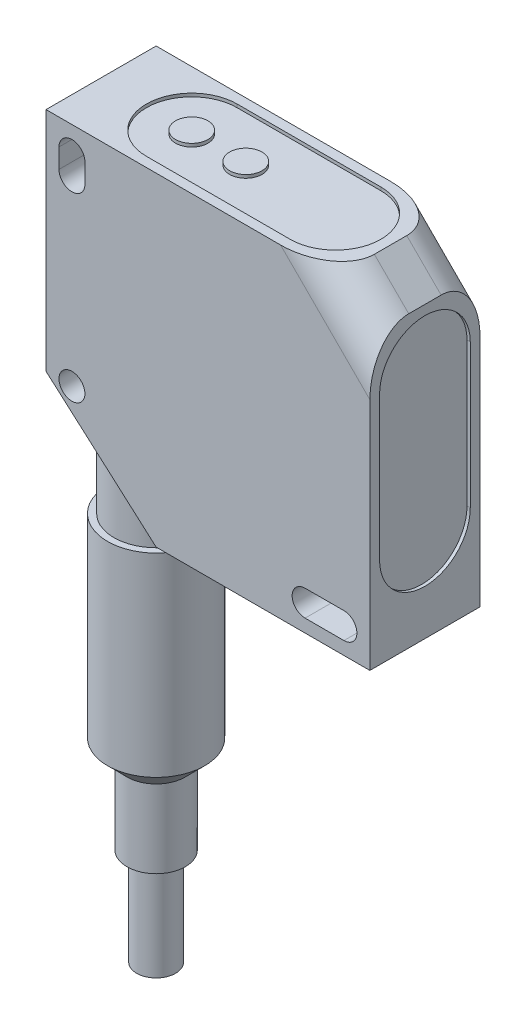
ISO-10303-21;
HEADER;
FILE_DESCRIPTION(('STEP AP214'),'2;1');
FILE_NAME('part.step','',(''),(''),'','','');
FILE_SCHEMA(('AUTOMOTIVE_DESIGN { 1 0 10303 214 1 1 1 1 }'));
ENDSEC;
DATA;
#1=APPLICATION_CONTEXT('core data for automotive mechanical design processes');
#2=APPLICATION_PROTOCOL_DEFINITION('international standard','automotive_design',2000,#1);
#3=PRODUCT_CONTEXT('',#1,'mechanical');
#4=PRODUCT('Part','Part','',(#3));
#5=PRODUCT_RELATED_PRODUCT_CATEGORY('part','',(#4));
#6=PRODUCT_DEFINITION_FORMATION('','',#4);
#7=PRODUCT_DEFINITION_CONTEXT('part definition',#1,'design');
#8=PRODUCT_DEFINITION('design','',#6,#7);
#9=PRODUCT_DEFINITION_SHAPE('','',#8);
#10=(LENGTH_UNIT() NAMED_UNIT(*) SI_UNIT(.MILLI.,.METRE.));
#11=(NAMED_UNIT(*) PLANE_ANGLE_UNIT() SI_UNIT($,.RADIAN.));
#12=(NAMED_UNIT(*) SI_UNIT($,.STERADIAN.) SOLID_ANGLE_UNIT());
#13=UNCERTAINTY_MEASURE_WITH_UNIT(LENGTH_MEASURE(1.E-05),#10,'distance_accuracy_value','');
#14=(GEOMETRIC_REPRESENTATION_CONTEXT(3) GLOBAL_UNCERTAINTY_ASSIGNED_CONTEXT((#13)) GLOBAL_UNIT_ASSIGNED_CONTEXT((#10,
#11,#12)) REPRESENTATION_CONTEXT('',''));
#15=CARTESIAN_POINT('',(0.,0.,0.));
#16=DIRECTION('',(0.,0.,1.));
#17=DIRECTION('',(1.,0.,0.));
#18=AXIS2_PLACEMENT_3D('',#15,#16,#17);
#19=CARTESIAN_POINT('',(8.50000000000001,-49.,8.5));
#20=DIRECTION('',(0.,-1.,0.));
#21=DIRECTION('',(0.,0.,-1.));
#22=AXIS2_PLACEMENT_3D('',#19,#20,#21);
#23=PLANE('',#22);
#24=CARTESIAN_POINT('',(8.50000000000001,-49.,8.5));
#25=DIRECTION('',(0.,-1.,0.));
#26=DIRECTION('',(0.,0.,-1.));
#27=AXIS2_PLACEMENT_3D('',#24,#25,#26);
#28=CIRCLE('',#27,3.99999999999998);
#29=CARTESIAN_POINT('',(8.50000000000001,-49.,4.50000000000002));
#30=VERTEX_POINT('',#29);
#31=EDGE_CURVE('E11',#30,#30,#28,.F.);
#32=ORIENTED_EDGE('',*,*,#31,.T.);
#33=EDGE_LOOP('',(#32));
#34=FACE_BOUND('',#33,.T.);
#35=CARTESIAN_POINT('',(8.50000000000001,-49.,8.5));
#36=DIRECTION('',(0.,-1.,0.));
#37=DIRECTION('',(0.,0.,-1.));
#38=AXIS2_PLACEMENT_3D('',#35,#36,#37);
#39=CIRCLE('',#38,4.5);
#40=CARTESIAN_POINT('',(8.50000000000001,-49.,4.));
#41=VERTEX_POINT('',#40);
#42=EDGE_CURVE('E267',#41,#41,#39,.T.);
#43=ORIENTED_EDGE('',*,*,#42,.T.);
#44=EDGE_LOOP('',(#43));
#45=FACE_BOUND('',#44,.T.);
#46=ADVANCED_FACE('F31',(#34,#45),#23,.T.);
#47=CARTESIAN_POINT('',(0.,50.,17.));
#48=DIRECTION('',(0.,0.,1.));
#49=DIRECTION('',(1.,0.,0.));
#50=AXIS2_PLACEMENT_3D('',#47,#48,#49);
#51=PLANE('',#50);
#52=CARTESIAN_POINT('',(4.,15.,17.));
#53=DIRECTION('',(0.,0.,1.));
#54=DIRECTION('',(1.,0.,0.));
#55=AXIS2_PLACEMENT_3D('',#52,#53,#54);
#56=CIRCLE('',#55,2.);
#57=CARTESIAN_POINT('',(6.,15.,17.));
#58=VERTEX_POINT('',#57);
#59=EDGE_CURVE('E314',#58,#58,#56,.T.);
#60=ORIENTED_EDGE('',*,*,#59,.F.);
#61=EDGE_LOOP('',(#60));
#62=FACE_BOUND('',#61,.T.);
#63=DIRECTION('',(0.,1.,0.));
#64=VECTOR('',#63,1.);
#65=CARTESIAN_POINT('',(50.,0.,17.));
#66=LINE('',#65,#64);
#67=CARTESIAN_POINT('',(50.,0.,17.));
#68=VERTEX_POINT('',#67);
#69=CARTESIAN_POINT('',(50.,36.2114177668624,17.));
#70=VERTEX_POINT('',#69);
#71=EDGE_CURVE('E360',#68,#70,#66,.T.);
#72=ORIENTED_EDGE('',*,*,#71,.T.);
#73=DIRECTION('',(-0.707106781186549,0.707106781186546,0.));
#74=VECTOR('',#73,1.);
#75=CARTESIAN_POINT('',(40.4540584539816,45.7573593128807,17.));
#76=LINE('',#75,#74);
#77=CARTESIAN_POINT('',(36.2114177668623,50.,17.));
#78=VERTEX_POINT('',#77);
#79=EDGE_CURVE('E405',#70,#78,#76,.T.);
#80=ORIENTED_EDGE('',*,*,#79,.T.);
#81=DIRECTION('',(-1.,0.,0.));
#82=VECTOR('',#81,1.);
#83=CARTESIAN_POINT('',(44.6966991411009,50.,17.));
#84=LINE('',#83,#82);
#85=CARTESIAN_POINT('',(0.,50.,17.));
#86=VERTEX_POINT('',#85);
#87=EDGE_CURVE('E351',#78,#86,#84,.T.);
#88=ORIENTED_EDGE('',*,*,#87,.T.);
#89=DIRECTION('',(0.,-1.,0.));
#90=VECTOR('',#89,1.);
#91=CARTESIAN_POINT('',(0.,50.,17.));
#92=LINE('',#91,#90);
#93=CARTESIAN_POINT('',(0.,15.,17.));
#94=VERTEX_POINT('',#93);
#95=EDGE_CURVE('E353',#86,#94,#92,.T.);
#96=ORIENTED_EDGE('',*,*,#95,.T.);
#97=DIRECTION('',(0.749837855365093,-0.661621637086846,0.));
#98=VECTOR('',#97,1.);
#99=CARTESIAN_POINT('',(0.,15.,17.));
#100=LINE('',#99,#98);
#101=CARTESIAN_POINT('',(17.,0.,17.));
#102=VERTEX_POINT('',#101);
#103=EDGE_CURVE('E356',#94,#102,#100,.T.);
#104=ORIENTED_EDGE('',*,*,#103,.T.);
#105=DIRECTION('',(1.,0.,0.));
#106=VECTOR('',#105,1.);
#107=CARTESIAN_POINT('',(17.,0.,17.));
#108=LINE('',#107,#106);
#109=EDGE_CURVE('E358',#102,#68,#108,.T.);
#110=ORIENTED_EDGE('',*,*,#109,.T.);
#111=EDGE_LOOP('',(#72,#80,#88,#96,#104,#110));
#112=FACE_BOUND('',#111,.T.);
#113=DIRECTION('',(0.,1.,0.));
#114=VECTOR('',#113,1.);
#115=CARTESIAN_POINT('',(6.,46.,17.));
#116=LINE('',#115,#114);
#117=CARTESIAN_POINT('',(6.,43.,17.));
#118=VERTEX_POINT('',#117);
#119=CARTESIAN_POINT('',(6.,46.,17.));
#120=VERTEX_POINT('',#119);
#121=EDGE_CURVE('E322',#118,#120,#116,.T.);
#122=ORIENTED_EDGE('',*,*,#121,.F.);
#123=CARTESIAN_POINT('',(4.,43.,17.));
#124=DIRECTION('',(0.,0.,1.));
#125=DIRECTION('',(1.,0.,0.));
#126=AXIS2_PLACEMENT_3D('',#123,#124,#125);
#127=CIRCLE('',#126,2.);
#128=CARTESIAN_POINT('',(2.,43.,17.));
#129=VERTEX_POINT('',#128);
#130=EDGE_CURVE('E320',#129,#118,#127,.T.);
#131=ORIENTED_EDGE('',*,*,#130,.F.);
#132=DIRECTION('',(0.,-1.,0.));
#133=VECTOR('',#132,1.);
#134=CARTESIAN_POINT('',(2.,43.,17.));
#135=LINE('',#134,#133);
#136=CARTESIAN_POINT('',(2.,46.,17.));
#137=VERTEX_POINT('',#136);
#138=EDGE_CURVE('E328',#137,#129,#135,.T.);
#139=ORIENTED_EDGE('',*,*,#138,.F.);
#140=CARTESIAN_POINT('',(4.,46.,17.));
#141=DIRECTION('',(0.,0.,1.));
#142=DIRECTION('',(-1.,0.,0.));
#143=AXIS2_PLACEMENT_3D('',#140,#141,#142);
#144=CIRCLE('',#143,2.);
#145=EDGE_CURVE('E325',#120,#137,#144,.T.);
#146=ORIENTED_EDGE('',*,*,#145,.F.);
#147=EDGE_LOOP('',(#122,#131,#139,#146));
#148=FACE_BOUND('',#147,.T.);
#149=DIRECTION('',(1.,0.,0.));
#150=VECTOR('',#149,1.);
#151=CARTESIAN_POINT('',(46.,2.,17.));
#152=LINE('',#151,#150);
#153=CARTESIAN_POINT('',(40.,2.,17.));
#154=VERTEX_POINT('',#153);
#155=CARTESIAN_POINT('',(46.,2.,17.));
#156=VERTEX_POINT('',#155);
#157=EDGE_CURVE('E285',#154,#156,#152,.T.);
#158=ORIENTED_EDGE('',*,*,#157,.F.);
#159=CARTESIAN_POINT('',(40.,4.,17.));
#160=DIRECTION('',(0.,0.,1.));
#161=DIRECTION('',(1.,0.,0.));
#162=AXIS2_PLACEMENT_3D('',#159,#160,#161);
#163=CIRCLE('',#162,2.);
#164=CARTESIAN_POINT('',(40.,6.,17.));
#165=VERTEX_POINT('',#164);
#166=EDGE_CURVE('E283',#165,#154,#163,.T.);
#167=ORIENTED_EDGE('',*,*,#166,.F.);
#168=DIRECTION('',(-1.,0.,0.));
#169=VECTOR('',#168,1.);
#170=CARTESIAN_POINT('',(40.,6.,17.));
#171=LINE('',#170,#169);
#172=CARTESIAN_POINT('',(46.,6.00000000000001,17.));
#173=VERTEX_POINT('',#172);
#174=EDGE_CURVE('E291',#173,#165,#171,.T.);
#175=ORIENTED_EDGE('',*,*,#174,.F.);
#176=CARTESIAN_POINT('',(46.,4.,17.));
#177=DIRECTION('',(0.,0.,1.));
#178=DIRECTION('',(-1.,0.,0.));
#179=AXIS2_PLACEMENT_3D('',#176,#177,#178);
#180=CIRCLE('',#179,2.);
#181=EDGE_CURVE('E288',#156,#173,#180,.T.);
#182=ORIENTED_EDGE('',*,*,#181,.F.);
#183=EDGE_LOOP('',(#158,#167,#175,#182));
#184=FACE_BOUND('',#183,.T.);
#185=ADVANCED_FACE('F430',(#62,#112,#148,#184),#51,.T.);
#186=CARTESIAN_POINT('',(0.,50.,0.));
#187=DIRECTION('',(0.,0.,1.));
#188=DIRECTION('',(1.,0.,0.));
#189=AXIS2_PLACEMENT_3D('',#186,#187,#188);
#190=PLANE('',#189);
#191=CARTESIAN_POINT('',(4.,15.,0.));
#192=DIRECTION('',(0.,0.,1.));
#193=DIRECTION('',(1.,0.,0.));
#194=AXIS2_PLACEMENT_3D('',#191,#192,#193);
#195=CIRCLE('',#194,2.);
#196=CARTESIAN_POINT('',(6.,15.,0.));
#197=VERTEX_POINT('',#196);
#198=EDGE_CURVE('E313',#197,#197,#195,.T.);
#199=ORIENTED_EDGE('',*,*,#198,.T.);
#200=EDGE_LOOP('',(#199));
#201=FACE_BOUND('',#200,.T.);
#202=DIRECTION('',(-1.,0.,0.));
#203=VECTOR('',#202,1.);
#204=CARTESIAN_POINT('',(44.6966991411009,50.,0.));
#205=LINE('',#204,#203);
#206=CARTESIAN_POINT('',(36.2114177668623,50.,0.));
#207=VERTEX_POINT('',#206);
#208=CARTESIAN_POINT('',(0.,50.,0.));
#209=VERTEX_POINT('',#208);
#210=EDGE_CURVE('E350',#207,#209,#205,.T.);
#211=ORIENTED_EDGE('',*,*,#210,.F.);
#212=DIRECTION('',(-0.707106781186549,0.707106781186546,0.));
#213=VECTOR('',#212,1.);
#214=CARTESIAN_POINT('',(18.105708883431,68.1057088834311,0.));
#215=LINE('',#214,#213);
#216=CARTESIAN_POINT('',(50.,36.2114177668624,0.));
#217=VERTEX_POINT('',#216);
#218=EDGE_CURVE('E399',#207,#217,#215,.F.);
#219=ORIENTED_EDGE('',*,*,#218,.T.);
#220=DIRECTION('',(0.,1.,0.));
#221=VECTOR('',#220,1.);
#222=CARTESIAN_POINT('',(50.,0.,0.));
#223=LINE('',#222,#221);
#224=CARTESIAN_POINT('',(50.,0.,0.));
#225=VERTEX_POINT('',#224);
#226=EDGE_CURVE('E354',#225,#217,#223,.T.);
#227=ORIENTED_EDGE('',*,*,#226,.F.);
#228=DIRECTION('',(1.,0.,0.));
#229=VECTOR('',#228,1.);
#230=CARTESIAN_POINT('',(17.,0.,0.));
#231=LINE('',#230,#229);
#232=CARTESIAN_POINT('',(17.,0.,0.));
#233=VERTEX_POINT('',#232);
#234=EDGE_CURVE('E369',#233,#225,#231,.T.);
#235=ORIENTED_EDGE('',*,*,#234,.F.);
#236=DIRECTION('',(0.749837855365093,-0.661621637086846,0.));
#237=VECTOR('',#236,1.);
#238=CARTESIAN_POINT('',(0.,15.,0.));
#239=LINE('',#238,#237);
#240=CARTESIAN_POINT('',(0.,15.,0.));
#241=VERTEX_POINT('',#240);
#242=EDGE_CURVE('E367',#241,#233,#239,.T.);
#243=ORIENTED_EDGE('',*,*,#242,.F.);
#244=DIRECTION('',(0.,-1.,0.));
#245=VECTOR('',#244,1.);
#246=CARTESIAN_POINT('',(0.,50.,0.));
#247=LINE('',#246,#245);
#248=EDGE_CURVE('E365',#209,#241,#247,.T.);
#249=ORIENTED_EDGE('',*,*,#248,.F.);
#250=EDGE_LOOP('',(#211,#219,#227,#235,#243,#249));
#251=FACE_BOUND('',#250,.T.);
#252=CARTESIAN_POINT('',(4.,43.,0.));
#253=DIRECTION('',(0.,0.,1.));
#254=DIRECTION('',(1.,0.,0.));
#255=AXIS2_PLACEMENT_3D('',#252,#253,#254);
#256=CIRCLE('',#255,2.);
#257=CARTESIAN_POINT('',(2.,43.,0.));
#258=VERTEX_POINT('',#257);
#259=CARTESIAN_POINT('',(6.,43.,0.));
#260=VERTEX_POINT('',#259);
#261=EDGE_CURVE('E317',#258,#260,#256,.T.);
#262=ORIENTED_EDGE('',*,*,#261,.T.);
#263=DIRECTION('',(0.,1.,0.));
#264=VECTOR('',#263,1.);
#265=CARTESIAN_POINT('',(6.,46.,0.));
#266=LINE('',#265,#264);
#267=CARTESIAN_POINT('',(6.,46.,0.));
#268=VERTEX_POINT('',#267);
#269=EDGE_CURVE('E333',#260,#268,#266,.T.);
#270=ORIENTED_EDGE('',*,*,#269,.T.);
#271=CARTESIAN_POINT('',(4.,46.,0.));
#272=DIRECTION('',(0.,0.,1.));
#273=DIRECTION('',(-1.,0.,0.));
#274=AXIS2_PLACEMENT_3D('',#271,#272,#273);
#275=CIRCLE('',#274,2.);
#276=CARTESIAN_POINT('',(2.,46.,0.));
#277=VERTEX_POINT('',#276);
#278=EDGE_CURVE('E336',#268,#277,#275,.T.);
#279=ORIENTED_EDGE('',*,*,#278,.T.);
#280=DIRECTION('',(0.,-1.,0.));
#281=VECTOR('',#280,1.);
#282=CARTESIAN_POINT('',(2.,43.,0.));
#283=LINE('',#282,#281);
#284=EDGE_CURVE('E323',#277,#258,#283,.T.);
#285=ORIENTED_EDGE('',*,*,#284,.T.);
#286=EDGE_LOOP('',(#262,#270,#279,#285));
#287=FACE_BOUND('',#286,.T.);
#288=CARTESIAN_POINT('',(40.,4.,0.));
#289=DIRECTION('',(0.,0.,1.));
#290=DIRECTION('',(1.,0.,0.));
#291=AXIS2_PLACEMENT_3D('',#288,#289,#290);
#292=CIRCLE('',#291,2.);
#293=CARTESIAN_POINT('',(40.,6.00000000000001,0.));
#294=VERTEX_POINT('',#293);
#295=CARTESIAN_POINT('',(40.,2.,0.));
#296=VERTEX_POINT('',#295);
#297=EDGE_CURVE('E282',#294,#296,#292,.T.);
#298=ORIENTED_EDGE('',*,*,#297,.T.);
#299=DIRECTION('',(1.,0.,0.));
#300=VECTOR('',#299,1.);
#301=CARTESIAN_POINT('',(46.,2.,0.));
#302=LINE('',#301,#300);
#303=CARTESIAN_POINT('',(46.,2.,0.));
#304=VERTEX_POINT('',#303);
#305=EDGE_CURVE('E296',#296,#304,#302,.T.);
#306=ORIENTED_EDGE('',*,*,#305,.T.);
#307=CARTESIAN_POINT('',(46.,4.,0.));
#308=DIRECTION('',(0.,0.,1.));
#309=DIRECTION('',(-1.,0.,0.));
#310=AXIS2_PLACEMENT_3D('',#307,#308,#309);
#311=CIRCLE('',#310,2.);
#312=CARTESIAN_POINT('',(46.,6.,0.));
#313=VERTEX_POINT('',#312);
#314=EDGE_CURVE('E299',#304,#313,#311,.T.);
#315=ORIENTED_EDGE('',*,*,#314,.T.);
#316=DIRECTION('',(-1.,0.,0.));
#317=VECTOR('',#316,1.);
#318=CARTESIAN_POINT('',(40.,6.,0.));
#319=LINE('',#318,#317);
#320=EDGE_CURVE('E286',#313,#294,#319,.T.);
#321=ORIENTED_EDGE('',*,*,#320,.T.);
#322=EDGE_LOOP('',(#298,#306,#315,#321));
#323=FACE_BOUND('',#322,.T.);
#324=ADVANCED_FACE('F436',(#201,#251,#287,#323),#190,.F.);
#325=CARTESIAN_POINT('',(44.6966991411009,50.,17.));
#326=DIRECTION('',(0.,-1.,0.));
#327=DIRECTION('',(1.,0.,0.));
#328=AXIS2_PLACEMENT_3D('',#325,#326,#327);
#329=PLANE('',#328);
#330=DIRECTION('',(1.,0.,0.));
#331=VECTOR('',#330,1.);
#332=CARTESIAN_POINT('',(36.1966991411009,50.,15.5));
#333=LINE('',#332,#331);
#334=CARTESIAN_POINT('',(14.,50.,15.5));
#335=VERTEX_POINT('',#334);
#336=CARTESIAN_POINT('',(36.1966991411009,50.,15.5));
#337=VERTEX_POINT('',#336);
#338=EDGE_CURVE('E224',#335,#337,#333,.T.);
#339=ORIENTED_EDGE('',*,*,#338,.F.);
#340=CARTESIAN_POINT('',(14.,50.,8.5));
#341=DIRECTION('',(0.,1.,0.));
#342=DIRECTION('',(-1.,0.,0.));
#343=AXIS2_PLACEMENT_3D('',#340,#341,#342);
#344=CIRCLE('',#343,7.);
#345=CARTESIAN_POINT('',(14.,50.,1.5));
#346=VERTEX_POINT('',#345);
#347=EDGE_CURVE('E46',#346,#335,#344,.T.);
#348=ORIENTED_EDGE('',*,*,#347,.F.);
#349=DIRECTION('',(-1.,0.,0.));
#350=VECTOR('',#349,1.);
#351=CARTESIAN_POINT('',(14.,50.,1.5));
#352=LINE('',#351,#350);
#353=CARTESIAN_POINT('',(36.1966991411009,50.,1.5));
#354=VERTEX_POINT('',#353);
#355=EDGE_CURVE('E212',#354,#346,#352,.T.);
#356=ORIENTED_EDGE('',*,*,#355,.F.);
#357=CARTESIAN_POINT('',(36.1966991411009,50.,8.5));
#358=DIRECTION('',(0.,1.,0.));
#359=DIRECTION('',(1.,0.,0.));
#360=AXIS2_PLACEMENT_3D('',#357,#358,#359);
#361=CIRCLE('',#360,7.);
#362=EDGE_CURVE('E215',#337,#354,#361,.T.);
#363=ORIENTED_EDGE('',*,*,#362,.F.);
#364=EDGE_LOOP('',(#339,#348,#356,#363));
#365=FACE_BOUND('',#364,.T.);
#366=DIRECTION('',(0.,0.,-1.));
#367=VECTOR('',#366,1.);
#368=CARTESIAN_POINT('',(44.6966991411009,50.,17.));
#369=LINE('',#368,#367);
#370=CARTESIAN_POINT('',(44.6966991411009,50.,11.));
#371=VERTEX_POINT('',#370);
#372=CARTESIAN_POINT('',(44.6966991411009,50.,6.));
#373=VERTEX_POINT('',#372);
#374=EDGE_CURVE('E363',#371,#373,#369,.T.);
#375=ORIENTED_EDGE('',*,*,#374,.T.);
#376=CARTESIAN_POINT('',(36.2114177668623,50.,6.));
#377=DIRECTION('',(0.,-1.,0.));
#378=DIRECTION('',(-1.,0.,0.));
#379=AXIS2_PLACEMENT_3D('',#376,#377,#378);
#380=ELLIPSE('',#379,8.48528137423859,6.);
#381=EDGE_CURVE('E397',#373,#207,#380,.F.);
#382=ORIENTED_EDGE('',*,*,#381,.T.);
#383=ORIENTED_EDGE('',*,*,#210,.T.);
#384=DIRECTION('',(0.,0.,-1.));
#385=VECTOR('',#384,1.);
#386=CARTESIAN_POINT('',(0.,50.,17.));
#387=LINE('',#386,#385);
#388=EDGE_CURVE('E387',#86,#209,#387,.T.);
#389=ORIENTED_EDGE('',*,*,#388,.F.);
#390=ORIENTED_EDGE('',*,*,#87,.F.);
#391=CARTESIAN_POINT('',(36.2114177668623,50.,11.));
#392=DIRECTION('',(0.,-1.,0.));
#393=DIRECTION('',(1.,0.,0.));
#394=AXIS2_PLACEMENT_3D('',#391,#392,#393);
#395=ELLIPSE('',#394,8.48528137423859,6.);
#396=EDGE_CURVE('E395',#78,#371,#395,.F.);
#397=ORIENTED_EDGE('',*,*,#396,.T.);
#398=EDGE_LOOP('',(#375,#382,#383,#389,#390,#397));
#399=FACE_BOUND('',#398,.T.);
#400=ADVANCED_FACE('F500',(#365,#399),#329,.F.);
#401=CARTESIAN_POINT('',(0.,50.,17.));
#402=DIRECTION('',(1.,0.,0.));
#403=DIRECTION('',(0.,1.,0.));
#404=AXIS2_PLACEMENT_3D('',#401,#402,#403);
#405=PLANE('',#404);
#406=ORIENTED_EDGE('',*,*,#248,.T.);
#407=DIRECTION('',(0.,0.,-1.));
#408=VECTOR('',#407,1.);
#409=CARTESIAN_POINT('',(0.,15.,17.));
#410=LINE('',#409,#408);
#411=EDGE_CURVE('E384',#94,#241,#410,.T.);
#412=ORIENTED_EDGE('',*,*,#411,.F.);
#413=ORIENTED_EDGE('',*,*,#95,.F.);
#414=ORIENTED_EDGE('',*,*,#388,.T.);
#415=EDGE_LOOP('',(#406,#412,#413,#414));
#416=FACE_BOUND('',#415,.T.);
#417=ADVANCED_FACE('F516',(#416),#405,.F.);
#418=CARTESIAN_POINT('',(0.,15.,17.));
#419=DIRECTION('',(0.661621637086846,0.749837855365093,0.));
#420=DIRECTION('',(-0.749837855365093,0.661621637086846,0.));
#421=AXIS2_PLACEMENT_3D('',#418,#419,#420);
#422=PLANE('',#421);
#423=CARTESIAN_POINT('',(8.50000000000001,7.49999999999318,8.5));
#424=DIRECTION('',(0.661621637086846,0.749837855365093,0.));
#425=DIRECTION('',(0.749837855365093,-0.661621637086846,0.));
#426=AXIS2_PLACEMENT_3D('',#423,#424,#425);
#427=ELLIPSE('',#426,8.66854074316531,6.5);
#428=CARTESIAN_POINT('',(15.,1.76470588234612,8.5));
#429=VERTEX_POINT('',#428);
#430=EDGE_CURVE('E279',#429,#429,#427,.F.);
#431=ORIENTED_EDGE('',*,*,#430,.F.);
#432=EDGE_LOOP('',(#431));
#433=FACE_BOUND('',#432,.T.);
#434=ORIENTED_EDGE('',*,*,#242,.T.);
#435=DIRECTION('',(0.,0.,-1.));
#436=VECTOR('',#435,1.);
#437=CARTESIAN_POINT('',(17.,0.,17.));
#438=LINE('',#437,#436);
#439=EDGE_CURVE('E381',#102,#233,#438,.T.);
#440=ORIENTED_EDGE('',*,*,#439,.F.);
#441=ORIENTED_EDGE('',*,*,#103,.F.);
#442=ORIENTED_EDGE('',*,*,#411,.T.);
#443=EDGE_LOOP('',(#434,#440,#441,#442));
#444=FACE_BOUND('',#443,.T.);
#445=ADVANCED_FACE('F512',(#433,#444),#422,.F.);
#446=CARTESIAN_POINT('',(17.,0.,17.));
#447=DIRECTION('',(0.,1.,0.));
#448=DIRECTION('',(0.,0.,1.));
#449=AXIS2_PLACEMENT_3D('',#446,#447,#448);
#450=PLANE('',#449);
#451=ORIENTED_EDGE('',*,*,#234,.T.);
#452=DIRECTION('',(0.,0.,-1.));
#453=VECTOR('',#452,1.);
#454=CARTESIAN_POINT('',(50.,0.,17.));
#455=LINE('',#454,#453);
#456=EDGE_CURVE('E378',#68,#225,#455,.T.);
#457=ORIENTED_EDGE('',*,*,#456,.F.);
#458=ORIENTED_EDGE('',*,*,#109,.F.);
#459=ORIENTED_EDGE('',*,*,#439,.T.);
#460=EDGE_LOOP('',(#451,#457,#458,#459));
#461=FACE_BOUND('',#460,.T.);
#462=ADVANCED_FACE('F508',(#461),#450,.F.);
#463=CARTESIAN_POINT('',(50.,0.,17.));
#464=DIRECTION('',(-1.,0.,0.));
#465=DIRECTION('',(0.,0.,1.));
#466=AXIS2_PLACEMENT_3D('',#463,#464,#465);
#467=PLANE('',#466);
#468=DIRECTION('',(0.,1.,0.));
#469=VECTOR('',#468,1.);
#470=CARTESIAN_POINT('',(50.,36.1966991411009,1.5));
#471=LINE('',#470,#469);
#472=CARTESIAN_POINT('',(50.,14.,1.49999999999999));
#473=VERTEX_POINT('',#472);
#474=CARTESIAN_POINT('',(50.,36.1966991411009,1.49999999999999));
#475=VERTEX_POINT('',#474);
#476=EDGE_CURVE('E249',#473,#475,#471,.T.);
#477=ORIENTED_EDGE('',*,*,#476,.F.);
#478=CARTESIAN_POINT('',(50.,14.,8.5));
#479=DIRECTION('',(1.,0.,0.));
#480=DIRECTION('',(0.,0.,-1.));
#481=AXIS2_PLACEMENT_3D('',#478,#479,#480);
#482=CIRCLE('',#481,7.00000000000001);
#483=CARTESIAN_POINT('',(50.,14.,15.5));
#484=VERTEX_POINT('',#483);
#485=EDGE_CURVE('E54',#484,#473,#482,.T.);
#486=ORIENTED_EDGE('',*,*,#485,.F.);
#487=DIRECTION('',(0.,-1.,0.));
#488=VECTOR('',#487,1.);
#489=CARTESIAN_POINT('',(50.,14.,15.5));
#490=LINE('',#489,#488);
#491=CARTESIAN_POINT('',(50.,36.1966991411009,15.5));
#492=VERTEX_POINT('',#491);
#493=EDGE_CURVE('E238',#492,#484,#490,.T.);
#494=ORIENTED_EDGE('',*,*,#493,.F.);
#495=CARTESIAN_POINT('',(50.,36.1966991411009,8.49999999999999));
#496=DIRECTION('',(1.,0.,0.));
#497=DIRECTION('',(0.,0.,1.));
#498=AXIS2_PLACEMENT_3D('',#495,#496,#497);
#499=CIRCLE('',#498,7.);
#500=EDGE_CURVE('E252',#475,#492,#499,.T.);
#501=ORIENTED_EDGE('',*,*,#500,.F.);
#502=EDGE_LOOP('',(#477,#486,#494,#501));
#503=FACE_BOUND('',#502,.T.);
#504=ORIENTED_EDGE('',*,*,#226,.T.);
#505=CARTESIAN_POINT('',(50.,36.2114177668624,6.));
#506=DIRECTION('',(-1.,0.,0.));
#507=DIRECTION('',(0.,1.,0.));
#508=AXIS2_PLACEMENT_3D('',#505,#506,#507);
#509=ELLIPSE('',#508,8.48528137423855,6.);
#510=CARTESIAN_POINT('',(50.,44.6966991411009,6.));
#511=VERTEX_POINT('',#510);
#512=EDGE_CURVE('E403',#217,#511,#509,.F.);
#513=ORIENTED_EDGE('',*,*,#512,.T.);
#514=DIRECTION('',(0.,0.,-1.));
#515=VECTOR('',#514,1.);
#516=CARTESIAN_POINT('',(50.,44.6966991411009,17.));
#517=LINE('',#516,#515);
#518=CARTESIAN_POINT('',(50.,44.6966991411009,11.));
#519=VERTEX_POINT('',#518);
#520=EDGE_CURVE('E375',#519,#511,#517,.T.);
#521=ORIENTED_EDGE('',*,*,#520,.F.);
#522=CARTESIAN_POINT('',(50.,36.2114177668624,11.));
#523=DIRECTION('',(-1.,0.,0.));
#524=DIRECTION('',(0.,-1.,0.));
#525=AXIS2_PLACEMENT_3D('',#522,#523,#524);
#526=ELLIPSE('',#525,8.48528137423855,6.);
#527=EDGE_CURVE('E401',#519,#70,#526,.F.);
#528=ORIENTED_EDGE('',*,*,#527,.T.);
#529=ORIENTED_EDGE('',*,*,#71,.F.);
#530=ORIENTED_EDGE('',*,*,#456,.T.);
#531=EDGE_LOOP('',(#504,#513,#521,#528,#529,#530));
#532=FACE_BOUND('',#531,.T.);
#533=ADVANCED_FACE('F504',(#503,#532),#467,.F.);
#534=CARTESIAN_POINT('',(50.,44.6966991411009,17.));
#535=DIRECTION('',(-0.707106781186546,-0.707106781186549,0.));
#536=DIRECTION('',(0.707106781186549,-0.707106781186546,0.));
#537=AXIS2_PLACEMENT_3D('',#534,#535,#536);
#538=PLANE('',#537);
#539=ORIENTED_EDGE('',*,*,#520,.T.);
#540=DIRECTION('',(-0.707106781186549,0.707106781186546,0.));
#541=VECTOR('',#540,1.);
#542=CARTESIAN_POINT('',(50.,44.6966991411009,6.));
#543=LINE('',#542,#541);
#544=EDGE_CURVE('E392',#511,#373,#543,.T.);
#545=ORIENTED_EDGE('',*,*,#544,.T.);
#546=ORIENTED_EDGE('',*,*,#374,.F.);
#547=DIRECTION('',(-0.707106781186549,0.707106781186546,0.));
#548=VECTOR('',#547,1.);
#549=CARTESIAN_POINT('',(50.,44.6966991411009,11.));
#550=LINE('',#549,#548);
#551=EDGE_CURVE('E390',#371,#519,#550,.F.);
#552=ORIENTED_EDGE('',*,*,#551,.T.);
#553=EDGE_LOOP('',(#539,#545,#546,#552));
#554=FACE_BOUND('',#553,.T.);
#555=ADVANCED_FACE('F495',(#554),#538,.F.);
#556=CARTESIAN_POINT('',(4.,43.,17.));
#557=DIRECTION('',(0.,0.,-1.));
#558=DIRECTION('',(-1.,0.,0.));
#559=AXIS2_PLACEMENT_3D('',#556,#557,#558);
#560=CYLINDRICAL_SURFACE('',#559,2.);
#561=ORIENTED_EDGE('',*,*,#261,.F.);
#562=DIRECTION('',(0.,0.,-1.));
#563=VECTOR('',#562,1.);
#564=CARTESIAN_POINT('',(2.,43.,17.));
#565=LINE('',#564,#563);
#566=EDGE_CURVE('E330',#129,#258,#565,.T.);
#567=ORIENTED_EDGE('',*,*,#566,.F.);
#568=ORIENTED_EDGE('',*,*,#130,.T.);
#569=DIRECTION('',(0.,0.,-1.));
#570=VECTOR('',#569,1.);
#571=CARTESIAN_POINT('',(6.,43.,17.));
#572=LINE('',#571,#570);
#573=EDGE_CURVE('E347',#118,#260,#572,.T.);
#574=ORIENTED_EDGE('',*,*,#573,.T.);
#575=EDGE_LOOP('',(#561,#567,#568,#574));
#576=FACE_BOUND('',#575,.T.);
#577=ADVANCED_FACE('F492',(#576),#560,.F.);
#578=CARTESIAN_POINT('',(6.,46.,17.));
#579=DIRECTION('',(-1.,0.,0.));
#580=DIRECTION('',(0.,0.,1.));
#581=AXIS2_PLACEMENT_3D('',#578,#579,#580);
#582=PLANE('',#581);
#583=ORIENTED_EDGE('',*,*,#269,.F.);
#584=ORIENTED_EDGE('',*,*,#573,.F.);
#585=ORIENTED_EDGE('',*,*,#121,.T.);
#586=DIRECTION('',(0.,0.,-1.));
#587=VECTOR('',#586,1.);
#588=CARTESIAN_POINT('',(6.,46.,17.));
#589=LINE('',#588,#587);
#590=EDGE_CURVE('E345',#120,#268,#589,.T.);
#591=ORIENTED_EDGE('',*,*,#590,.T.);
#592=EDGE_LOOP('',(#583,#584,#585,#591));
#593=FACE_BOUND('',#592,.T.);
#594=ADVANCED_FACE('F488',(#593),#582,.T.);
#595=CARTESIAN_POINT('',(4.,46.,17.));
#596=DIRECTION('',(0.,0.,-1.));
#597=DIRECTION('',(-1.,0.,0.));
#598=AXIS2_PLACEMENT_3D('',#595,#596,#597);
#599=CYLINDRICAL_SURFACE('',#598,2.);
#600=ORIENTED_EDGE('',*,*,#278,.F.);
#601=ORIENTED_EDGE('',*,*,#590,.F.);
#602=ORIENTED_EDGE('',*,*,#145,.T.);
#603=DIRECTION('',(0.,0.,-1.));
#604=VECTOR('',#603,1.);
#605=CARTESIAN_POINT('',(2.,46.,17.));
#606=LINE('',#605,#604);
#607=EDGE_CURVE('E343',#137,#277,#606,.T.);
#608=ORIENTED_EDGE('',*,*,#607,.T.);
#609=EDGE_LOOP('',(#600,#601,#602,#608));
#610=FACE_BOUND('',#609,.T.);
#611=ADVANCED_FACE('F484',(#610),#599,.F.);
#612=CARTESIAN_POINT('',(2.,43.,17.));
#613=DIRECTION('',(1.,0.,0.));
#614=DIRECTION('',(0.,1.,0.));
#615=AXIS2_PLACEMENT_3D('',#612,#613,#614);
#616=PLANE('',#615);
#617=ORIENTED_EDGE('',*,*,#284,.F.);
#618=ORIENTED_EDGE('',*,*,#607,.F.);
#619=ORIENTED_EDGE('',*,*,#138,.T.);
#620=ORIENTED_EDGE('',*,*,#566,.T.);
#621=EDGE_LOOP('',(#617,#618,#619,#620));
#622=FACE_BOUND('',#621,.T.);
#623=ADVANCED_FACE('F480',(#622),#616,.T.);
#624=CARTESIAN_POINT('',(4.,15.,17.));
#625=DIRECTION('',(0.,0.,-1.));
#626=DIRECTION('',(-1.,0.,0.));
#627=AXIS2_PLACEMENT_3D('',#624,#625,#626);
#628=CYLINDRICAL_SURFACE('',#627,2.);
#629=ORIENTED_EDGE('',*,*,#59,.T.);
#630=EDGE_LOOP('',(#629));
#631=FACE_BOUND('',#630,.T.);
#632=ORIENTED_EDGE('',*,*,#198,.F.);
#633=EDGE_LOOP('',(#632));
#634=FACE_BOUND('',#633,.T.);
#635=ADVANCED_FACE('F476',(#631,#634),#628,.F.);
#636=CARTESIAN_POINT('',(40.,4.,17.));
#637=DIRECTION('',(0.,0.,-1.));
#638=DIRECTION('',(-1.,0.,0.));
#639=AXIS2_PLACEMENT_3D('',#636,#637,#638);
#640=CYLINDRICAL_SURFACE('',#639,2.);
#641=ORIENTED_EDGE('',*,*,#297,.F.);
#642=DIRECTION('',(0.,0.,-1.));
#643=VECTOR('',#642,1.);
#644=CARTESIAN_POINT('',(40.,6.,17.));
#645=LINE('',#644,#643);
#646=EDGE_CURVE('E293',#165,#294,#645,.T.);
#647=ORIENTED_EDGE('',*,*,#646,.F.);
#648=ORIENTED_EDGE('',*,*,#166,.T.);
#649=DIRECTION('',(0.,0.,-1.));
#650=VECTOR('',#649,1.);
#651=CARTESIAN_POINT('',(40.,2.,17.));
#652=LINE('',#651,#650);
#653=EDGE_CURVE('E310',#154,#296,#652,.T.);
#654=ORIENTED_EDGE('',*,*,#653,.T.);
#655=EDGE_LOOP('',(#641,#647,#648,#654));
#656=FACE_BOUND('',#655,.T.);
#657=ADVANCED_FACE('F472',(#656),#640,.F.);
#658=CARTESIAN_POINT('',(46.,2.,17.));
#659=DIRECTION('',(0.,1.,0.));
#660=DIRECTION('',(-1.,0.,0.));
#661=AXIS2_PLACEMENT_3D('',#658,#659,#660);
#662=PLANE('',#661);
#663=ORIENTED_EDGE('',*,*,#305,.F.);
#664=ORIENTED_EDGE('',*,*,#653,.F.);
#665=ORIENTED_EDGE('',*,*,#157,.T.);
#666=DIRECTION('',(0.,0.,-1.));
#667=VECTOR('',#666,1.);
#668=CARTESIAN_POINT('',(46.,2.,17.));
#669=LINE('',#668,#667);
#670=EDGE_CURVE('E308',#156,#304,#669,.T.);
#671=ORIENTED_EDGE('',*,*,#670,.T.);
#672=EDGE_LOOP('',(#663,#664,#665,#671));
#673=FACE_BOUND('',#672,.T.);
#674=ADVANCED_FACE('F468',(#673),#662,.T.);
#675=CARTESIAN_POINT('',(46.,4.,17.));
#676=DIRECTION('',(0.,0.,-1.));
#677=DIRECTION('',(-1.,0.,0.));
#678=AXIS2_PLACEMENT_3D('',#675,#676,#677);
#679=CYLINDRICAL_SURFACE('',#678,2.);
#680=ORIENTED_EDGE('',*,*,#314,.F.);
#681=ORIENTED_EDGE('',*,*,#670,.F.);
#682=ORIENTED_EDGE('',*,*,#181,.T.);
#683=DIRECTION('',(0.,0.,-1.));
#684=VECTOR('',#683,1.);
#685=CARTESIAN_POINT('',(46.,6.,17.));
#686=LINE('',#685,#684);
#687=EDGE_CURVE('E306',#173,#313,#686,.T.);
#688=ORIENTED_EDGE('',*,*,#687,.T.);
#689=EDGE_LOOP('',(#680,#681,#682,#688));
#690=FACE_BOUND('',#689,.T.);
#691=ADVANCED_FACE('F464',(#690),#679,.F.);
#692=CARTESIAN_POINT('',(40.,6.,17.));
#693=DIRECTION('',(0.,-1.,0.));
#694=DIRECTION('',(0.,0.,-1.));
#695=AXIS2_PLACEMENT_3D('',#692,#693,#694);
#696=PLANE('',#695);
#697=ORIENTED_EDGE('',*,*,#320,.F.);
#698=ORIENTED_EDGE('',*,*,#687,.F.);
#699=ORIENTED_EDGE('',*,*,#174,.T.);
#700=ORIENTED_EDGE('',*,*,#646,.T.);
#701=EDGE_LOOP('',(#697,#698,#699,#700));
#702=FACE_BOUND('',#701,.T.);
#703=ADVANCED_FACE('F460',(#702),#696,.T.);
#704=CARTESIAN_POINT('',(45.7573593128807,40.4540584539816,6.));
#705=DIRECTION('',(-0.707106781186549,0.707106781186546,0.));
#706=DIRECTION('',(-0.707106781186546,-0.707106781186549,0.));
#707=AXIS2_PLACEMENT_3D('',#704,#705,#706);
#708=CYLINDRICAL_SURFACE('',#707,6.);
#709=ORIENTED_EDGE('',*,*,#512,.F.);
#710=ORIENTED_EDGE('',*,*,#218,.F.);
#711=ORIENTED_EDGE('',*,*,#381,.F.);
#712=ORIENTED_EDGE('',*,*,#544,.F.);
#713=EDGE_LOOP('',(#709,#710,#711,#712));
#714=FACE_BOUND('',#713,.T.);
#715=ADVANCED_FACE('F463',(#714),#708,.T.);
#716=CARTESIAN_POINT('',(18.105708883431,68.1057088834311,11.));
#717=DIRECTION('',(0.707106781186549,-0.707106781186546,0.));
#718=DIRECTION('',(0.707106781186546,0.707106781186549,0.));
#719=AXIS2_PLACEMENT_3D('',#716,#717,#718);
#720=CYLINDRICAL_SURFACE('',#719,6.);
#721=ORIENTED_EDGE('',*,*,#527,.F.);
#722=ORIENTED_EDGE('',*,*,#551,.F.);
#723=ORIENTED_EDGE('',*,*,#396,.F.);
#724=ORIENTED_EDGE('',*,*,#79,.F.);
#725=EDGE_LOOP('',(#721,#722,#723,#724));
#726=FACE_BOUND('',#725,.T.);
#727=ADVANCED_FACE('F458',(#726),#720,.T.);
#728=CARTESIAN_POINT('',(8.50000000000001,500000.,8.5));
#729=DIRECTION('',(0.,-1.,0.));
#730=DIRECTION('',(0.,0.,-1.));
#731=AXIS2_PLACEMENT_3D('',#728,#729,#730);
#732=CYLINDRICAL_SURFACE('',#731,6.5);
#733=ORIENTED_EDGE('',*,*,#430,.T.);
#734=EDGE_LOOP('',(#733));
#735=FACE_BOUND('',#734,.T.);
#736=CARTESIAN_POINT('',(8.50000000000001,-4.,8.5));
#737=DIRECTION('',(0.,-1.,0.));
#738=DIRECTION('',(0.,0.,-1.));
#739=AXIS2_PLACEMENT_3D('',#736,#737,#738);
#740=CIRCLE('',#739,6.5);
#741=CARTESIAN_POINT('',(8.50000000000001,-4.,2.));
#742=VERTEX_POINT('',#741);
#743=EDGE_CURVE('E274',#742,#742,#740,.T.);
#744=ORIENTED_EDGE('',*,*,#743,.F.);
#745=EDGE_LOOP('',(#744));
#746=FACE_BOUND('',#745,.T.);
#747=ADVANCED_FACE('F454',(#735,#746),#732,.T.);
#748=CARTESIAN_POINT('',(8.50000000000001,-34.,8.5));
#749=DIRECTION('',(0.,1.,0.));
#750=DIRECTION('',(0.,0.,1.));
#751=AXIS2_PLACEMENT_3D('',#748,#749,#750);
#752=CYLINDRICAL_SURFACE('',#751,7.5);
#753=CARTESIAN_POINT('',(8.50000000000001,-34.,8.5));
#754=DIRECTION('',(0.,-1.,0.));
#755=DIRECTION('',(0.,0.,-1.));
#756=AXIS2_PLACEMENT_3D('',#753,#754,#755);
#757=CIRCLE('',#756,7.5);
#758=CARTESIAN_POINT('',(8.50000000000001,-34.,1.));
#759=VERTEX_POINT('',#758);
#760=EDGE_CURVE('E271',#759,#759,#757,.T.);
#761=ORIENTED_EDGE('',*,*,#760,.F.);
#762=EDGE_LOOP('',(#761));
#763=FACE_BOUND('',#762,.T.);
#764=CARTESIAN_POINT('',(8.50000000000001,-4.,8.5));
#765=DIRECTION('',(0.,-1.,0.));
#766=DIRECTION('',(0.,0.,-1.));
#767=AXIS2_PLACEMENT_3D('',#764,#765,#766);
#768=CIRCLE('',#767,7.5);
#769=CARTESIAN_POINT('',(8.50000000000001,-4.,1.));
#770=VERTEX_POINT('',#769);
#771=EDGE_CURVE('E270',#770,#770,#768,.T.);
#772=ORIENTED_EDGE('',*,*,#771,.T.);
#773=EDGE_LOOP('',(#772));
#774=FACE_BOUND('',#773,.T.);
#775=ADVANCED_FACE('F450',(#763,#774),#752,.T.);
#776=CARTESIAN_POINT('',(8.50000000000001,-4.,8.5));
#777=DIRECTION('',(0.,-1.,0.));
#778=DIRECTION('',(0.,0.,-1.));
#779=AXIS2_PLACEMENT_3D('',#776,#777,#778);
#780=PLANE('',#779);
#781=ORIENTED_EDGE('',*,*,#743,.T.);
#782=EDGE_LOOP('',(#781));
#783=FACE_BOUND('',#782,.T.);
#784=ORIENTED_EDGE('',*,*,#771,.F.);
#785=EDGE_LOOP('',(#784));
#786=FACE_BOUND('',#785,.T.);
#787=ADVANCED_FACE('F446',(#783,#786),#780,.F.);
#788=CARTESIAN_POINT('',(8.50000000000001,-49.,8.5));
#789=DIRECTION('',(0.,1.,0.));
#790=DIRECTION('',(0.,0.,1.));
#791=AXIS2_PLACEMENT_3D('',#788,#789,#790);
#792=CYLINDRICAL_SURFACE('',#791,4.5);
#793=CARTESIAN_POINT('',(8.50000000000001,-37.,8.5));
#794=DIRECTION('',(0.,-1.,0.));
#795=DIRECTION('',(0.,0.,-1.));
#796=AXIS2_PLACEMENT_3D('',#793,#794,#795);
#797=CIRCLE('',#796,4.5);
#798=CARTESIAN_POINT('',(8.50000000000001,-37.,4.));
#799=VERTEX_POINT('',#798);
#800=EDGE_CURVE('E408',#799,#799,#797,.T.);
#801=ORIENTED_EDGE('',*,*,#800,.T.);
#802=EDGE_LOOP('',(#801));
#803=FACE_BOUND('',#802,.T.);
#804=ORIENTED_EDGE('',*,*,#42,.F.);
#805=EDGE_LOOP('',(#804));
#806=FACE_BOUND('',#805,.T.);
#807=ADVANCED_FACE('F442',(#803,#806),#792,.T.);
#808=CARTESIAN_POINT('',(8.50000000000001,-37.,8.5));
#809=DIRECTION('',(0.,1.,0.));
#810=DIRECTION('',(0.,0.,1.));
#811=AXIS2_PLACEMENT_3D('',#808,#809,#810);
#812=CONICAL_SURFACE('',#811,4.5,0.785398163397442);
#813=ORIENTED_EDGE('',*,*,#760,.T.);
#814=EDGE_LOOP('',(#813));
#815=FACE_BOUND('',#814,.T.);
#816=ORIENTED_EDGE('',*,*,#800,.F.);
#817=EDGE_LOOP('',(#816));
#818=FACE_BOUND('',#817,.T.);
#819=ADVANCED_FACE('F445',(#815,#818),#812,.T.);
#820=CARTESIAN_POINT('',(8.50000000000001,-64.,8.5));
#821=DIRECTION('',(0.,1.,0.));
#822=DIRECTION('',(0.,0.,1.));
#823=AXIS2_PLACEMENT_3D('',#820,#821,#822);
#824=CYLINDRICAL_SURFACE('',#823,3.);
#825=CARTESIAN_POINT('',(8.50000000000001,-50.,8.5));
#826=DIRECTION('',(0.,-1.,0.));
#827=DIRECTION('',(0.,0.,-1.));
#828=AXIS2_PLACEMENT_3D('',#825,#826,#827);
#829=CIRCLE('',#828,3.);
#830=CARTESIAN_POINT('',(8.50000000000001,-50.,5.5));
#831=VERTEX_POINT('',#830);
#832=EDGE_CURVE('E39',#831,#831,#829,.T.);
#833=ORIENTED_EDGE('',*,*,#832,.T.);
#834=EDGE_LOOP('',(#833));
#835=FACE_BOUND('',#834,.T.);
#836=CARTESIAN_POINT('',(8.50000000000001,-64.,8.5));
#837=DIRECTION('',(0.,-1.,0.));
#838=DIRECTION('',(0.,0.,-1.));
#839=AXIS2_PLACEMENT_3D('',#836,#837,#838);
#840=CIRCLE('',#839,3.);
#841=CARTESIAN_POINT('',(8.50000000000001,-64.,5.5));
#842=VERTEX_POINT('',#841);
#843=EDGE_CURVE('E259',#842,#842,#840,.T.);
#844=ORIENTED_EDGE('',*,*,#843,.F.);
#845=EDGE_LOOP('',(#844));
#846=FACE_BOUND('',#845,.T.);
#847=ADVANCED_FACE('F413',(#835,#846),#824,.T.);
#848=CARTESIAN_POINT('',(8.50000000000001,-64.,8.5));
#849=DIRECTION('',(0.,-1.,0.));
#850=DIRECTION('',(0.,0.,-1.));
#851=AXIS2_PLACEMENT_3D('',#848,#849,#850);
#852=PLANE('',#851);
#853=ORIENTED_EDGE('',*,*,#843,.T.);
#854=EDGE_LOOP('',(#853));
#855=FACE_BOUND('',#854,.T.);
#856=ADVANCED_FACE('F418',(#855),#852,.T.);
#857=CARTESIAN_POINT('',(8.50000000000001,-50.,8.5));
#858=DIRECTION('',(0.,1.,0.));
#859=DIRECTION('',(0.,0.,1.));
#860=AXIS2_PLACEMENT_3D('',#857,#858,#859);
#861=CONICAL_SURFACE('',#860,3.,0.785398163397446);
#862=ORIENTED_EDGE('',*,*,#31,.F.);
#863=EDGE_LOOP('',(#862));
#864=FACE_BOUND('',#863,.T.);
#865=ORIENTED_EDGE('',*,*,#832,.F.);
#866=EDGE_LOOP('',(#865));
#867=FACE_BOUND('',#866,.T.);
#868=ADVANCED_FACE('F33',(#864,#867),#861,.T.);
#869=CARTESIAN_POINT('',(49.5,14.,8.5));
#870=DIRECTION('',(1.,0.,0.));
#871=DIRECTION('',(0.,0.,-1.));
#872=AXIS2_PLACEMENT_3D('',#869,#870,#871);
#873=CYLINDRICAL_SURFACE('',#872,7.00000000000001);
#874=ORIENTED_EDGE('',*,*,#485,.T.);
#875=DIRECTION('',(1.,0.,0.));
#876=VECTOR('',#875,1.);
#877=CARTESIAN_POINT('',(49.5,14.,1.49999999999999));
#878=LINE('',#877,#876);
#879=CARTESIAN_POINT('',(49.5,14.,1.49999999999999));
#880=VERTEX_POINT('',#879);
#881=EDGE_CURVE('E247',#880,#473,#878,.T.);
#882=ORIENTED_EDGE('',*,*,#881,.F.);
#883=CARTESIAN_POINT('',(49.5,14.,8.5));
#884=DIRECTION('',(1.,0.,0.));
#885=DIRECTION('',(0.,0.,-1.));
#886=AXIS2_PLACEMENT_3D('',#883,#884,#885);
#887=CIRCLE('',#886,7.00000000000001);
#888=CARTESIAN_POINT('',(49.5,14.,15.5));
#889=VERTEX_POINT('',#888);
#890=EDGE_CURVE('E234',#889,#880,#887,.T.);
#891=ORIENTED_EDGE('',*,*,#890,.F.);
#892=DIRECTION('',(1.,0.,0.));
#893=VECTOR('',#892,1.);
#894=CARTESIAN_POINT('',(49.5,14.,15.5));
#895=LINE('',#894,#893);
#896=EDGE_CURVE('E257',#889,#484,#895,.T.);
#897=ORIENTED_EDGE('',*,*,#896,.T.);
#898=EDGE_LOOP('',(#874,#882,#891,#897));
#899=FACE_BOUND('',#898,.T.);
#900=ADVANCED_FACE('F417',(#899),#873,.F.);
#901=CARTESIAN_POINT('',(49.5,14.,15.5));
#902=DIRECTION('',(0.,0.,1.));
#903=DIRECTION('',(1.,0.,0.));
#904=AXIS2_PLACEMENT_3D('',#901,#902,#903);
#905=PLANE('',#904);
#906=ORIENTED_EDGE('',*,*,#493,.T.);
#907=ORIENTED_EDGE('',*,*,#896,.F.);
#908=DIRECTION('',(0.,-1.,0.));
#909=VECTOR('',#908,1.);
#910=CARTESIAN_POINT('',(49.5,14.,15.5));
#911=LINE('',#910,#909);
#912=CARTESIAN_POINT('',(49.5,36.1966991411009,15.5));
#913=VERTEX_POINT('',#912);
#914=EDGE_CURVE('E244',#913,#889,#911,.T.);
#915=ORIENTED_EDGE('',*,*,#914,.F.);
#916=DIRECTION('',(1.,0.,0.));
#917=VECTOR('',#916,1.);
#918=CARTESIAN_POINT('',(49.5,36.1966991411009,15.5));
#919=LINE('',#918,#917);
#920=EDGE_CURVE('E260',#913,#492,#919,.T.);
#921=ORIENTED_EDGE('',*,*,#920,.T.);
#922=EDGE_LOOP('',(#906,#907,#915,#921));
#923=FACE_BOUND('',#922,.T.);
#924=ADVANCED_FACE('F424',(#923),#905,.F.);
#925=CARTESIAN_POINT('',(49.5,36.1966991411009,8.49999999999999));
#926=DIRECTION('',(1.,0.,0.));
#927=DIRECTION('',(0.,0.,-1.));
#928=AXIS2_PLACEMENT_3D('',#925,#926,#927);
#929=CYLINDRICAL_SURFACE('',#928,7.);
#930=ORIENTED_EDGE('',*,*,#500,.T.);
#931=ORIENTED_EDGE('',*,*,#920,.F.);
#932=CARTESIAN_POINT('',(49.5,36.1966991411009,8.49999999999999));
#933=DIRECTION('',(1.,0.,0.));
#934=DIRECTION('',(0.,0.,1.));
#935=AXIS2_PLACEMENT_3D('',#932,#933,#934);
#936=CIRCLE('',#935,7.);
#937=CARTESIAN_POINT('',(49.5,36.1966991411009,1.49999999999999));
#938=VERTEX_POINT('',#937);
#939=EDGE_CURVE('E241',#938,#913,#936,.T.);
#940=ORIENTED_EDGE('',*,*,#939,.F.);
#941=DIRECTION('',(1.,0.,0.));
#942=VECTOR('',#941,1.);
#943=CARTESIAN_POINT('',(49.5,36.1966991411009,1.49999999999999));
#944=LINE('',#943,#942);
#945=EDGE_CURVE('E262',#938,#475,#944,.T.);
#946=ORIENTED_EDGE('',*,*,#945,.T.);
#947=EDGE_LOOP('',(#930,#931,#940,#946));
#948=FACE_BOUND('',#947,.T.);
#949=ADVANCED_FACE('F801',(#948),#929,.F.);
#950=CARTESIAN_POINT('',(49.5,36.1966991411009,1.5));
#951=DIRECTION('',(0.,0.,-1.));
#952=DIRECTION('',(0.,1.,0.));
#953=AXIS2_PLACEMENT_3D('',#950,#951,#952);
#954=PLANE('',#953);
#955=ORIENTED_EDGE('',*,*,#476,.T.);
#956=ORIENTED_EDGE('',*,*,#945,.F.);
#957=DIRECTION('',(0.,1.,0.));
#958=VECTOR('',#957,1.);
#959=CARTESIAN_POINT('',(49.5,36.1966991411009,1.5));
#960=LINE('',#959,#958);
#961=EDGE_CURVE('E237',#880,#938,#960,.T.);
#962=ORIENTED_EDGE('',*,*,#961,.F.);
#963=ORIENTED_EDGE('',*,*,#881,.T.);
#964=EDGE_LOOP('',(#955,#956,#962,#963));
#965=FACE_BOUND('',#964,.T.);
#966=ADVANCED_FACE('F794',(#965),#954,.F.);
#967=CARTESIAN_POINT('',(49.5,14.,8.5));
#968=DIRECTION('',(1.,0.,0.));
#969=DIRECTION('',(0.,0.,-1.));
#970=AXIS2_PLACEMENT_3D('',#967,#968,#969);
#971=PLANE('',#970);
#972=ORIENTED_EDGE('',*,*,#890,.T.);
#973=ORIENTED_EDGE('',*,*,#961,.T.);
#974=ORIENTED_EDGE('',*,*,#939,.T.);
#975=ORIENTED_EDGE('',*,*,#914,.T.);
#976=EDGE_LOOP('',(#972,#973,#974,#975));
#977=FACE_BOUND('',#976,.T.);
#978=ADVANCED_FACE('F706',(#977),#971,.T.);
#979=CARTESIAN_POINT('',(14.,49.5,8.5));
#980=DIRECTION('',(0.,1.,0.));
#981=DIRECTION('',(-1.,0.,0.));
#982=AXIS2_PLACEMENT_3D('',#979,#980,#981);
#983=CYLINDRICAL_SURFACE('',#982,7.);
#984=ORIENTED_EDGE('',*,*,#347,.T.);
#985=DIRECTION('',(0.,1.,0.));
#986=VECTOR('',#985,1.);
#987=CARTESIAN_POINT('',(14.,49.5,15.5));
#988=LINE('',#987,#986);
#989=CARTESIAN_POINT('',(14.,49.5,15.5));
#990=VERTEX_POINT('',#989);
#991=EDGE_CURVE('E190',#990,#335,#988,.T.);
#992=ORIENTED_EDGE('',*,*,#991,.F.);
#993=CARTESIAN_POINT('',(14.,49.5,8.5));
#994=DIRECTION('',(0.,1.,0.));
#995=DIRECTION('',(-1.,0.,0.));
#996=AXIS2_PLACEMENT_3D('',#993,#994,#995);
#997=CIRCLE('',#996,7.);
#998=CARTESIAN_POINT('',(14.,49.5,1.5));
#999=VERTEX_POINT('',#998);
#1000=EDGE_CURVE('E194',#999,#990,#997,.T.);
#1001=ORIENTED_EDGE('',*,*,#1000,.F.);
#1002=DIRECTION('',(0.,1.,0.));
#1003=VECTOR('',#1002,1.);
#1004=CARTESIAN_POINT('',(14.,49.5,1.5));
#1005=LINE('',#1004,#1003);
#1006=EDGE_CURVE('E229',#999,#346,#1005,.T.);
#1007=ORIENTED_EDGE('',*,*,#1006,.T.);
#1008=EDGE_LOOP('',(#984,#992,#1001,#1007));
#1009=FACE_BOUND('',#1008,.T.);
#1010=ADVANCED_FACE('F192',(#1009),#983,.F.);
#1011=CARTESIAN_POINT('',(14.,49.5,1.5));
#1012=DIRECTION('',(0.,0.,-1.));
#1013=DIRECTION('',(-1.,0.,0.));
#1014=AXIS2_PLACEMENT_3D('',#1011,#1012,#1013);
#1015=PLANE('',#1014);
#1016=ORIENTED_EDGE('',*,*,#355,.T.);
#1017=ORIENTED_EDGE('',*,*,#1006,.F.);
#1018=DIRECTION('',(-1.,0.,0.));
#1019=VECTOR('',#1018,1.);
#1020=CARTESIAN_POINT('',(14.,49.5,1.5));
#1021=LINE('',#1020,#1019);
#1022=CARTESIAN_POINT('',(36.1966991411009,49.5,1.5));
#1023=VERTEX_POINT('',#1022);
#1024=EDGE_CURVE('E200',#1023,#999,#1021,.T.);
#1025=ORIENTED_EDGE('',*,*,#1024,.F.);
#1026=DIRECTION('',(0.,1.,0.));
#1027=VECTOR('',#1026,1.);
#1028=CARTESIAN_POINT('',(36.1966991411009,49.5,1.5));
#1029=LINE('',#1028,#1027);
#1030=EDGE_CURVE('E231',#1023,#354,#1029,.T.);
#1031=ORIENTED_EDGE('',*,*,#1030,.T.);
#1032=EDGE_LOOP('',(#1016,#1017,#1025,#1031));
#1033=FACE_BOUND('',#1032,.T.);
#1034=ADVANCED_FACE('F715',(#1033),#1015,.F.);
#1035=CARTESIAN_POINT('',(36.1966991411009,49.5,8.5));
#1036=DIRECTION('',(0.,1.,0.));
#1037=DIRECTION('',(-1.,0.,0.));
#1038=AXIS2_PLACEMENT_3D('',#1035,#1036,#1037);
#1039=CYLINDRICAL_SURFACE('',#1038,7.);
#1040=ORIENTED_EDGE('',*,*,#362,.T.);
#1041=ORIENTED_EDGE('',*,*,#1030,.F.);
#1042=CARTESIAN_POINT('',(36.1966991411009,49.5,8.5));
#1043=DIRECTION('',(0.,1.,0.));
#1044=DIRECTION('',(1.,0.,0.));
#1045=AXIS2_PLACEMENT_3D('',#1042,#1043,#1044);
#1046=CIRCLE('',#1045,7.);
#1047=CARTESIAN_POINT('',(36.1966991411009,49.5,15.5));
#1048=VERTEX_POINT('',#1047);
#1049=EDGE_CURVE('E208',#1048,#1023,#1046,.T.);
#1050=ORIENTED_EDGE('',*,*,#1049,.F.);
#1051=DIRECTION('',(0.,1.,0.));
#1052=VECTOR('',#1051,1.);
#1053=CARTESIAN_POINT('',(36.1966991411009,49.5,15.5));
#1054=LINE('',#1053,#1052);
#1055=EDGE_CURVE('E199',#1048,#337,#1054,.T.);
#1056=ORIENTED_EDGE('',*,*,#1055,.T.);
#1057=EDGE_LOOP('',(#1040,#1041,#1050,#1056));
#1058=FACE_BOUND('',#1057,.T.);
#1059=ADVANCED_FACE('F725',(#1058),#1039,.F.);
#1060=CARTESIAN_POINT('',(36.1966991411009,49.5,15.5));
#1061=DIRECTION('',(0.,0.,1.));
#1062=DIRECTION('',(1.,0.,0.));
#1063=AXIS2_PLACEMENT_3D('',#1060,#1061,#1062);
#1064=PLANE('',#1063);
#1065=ORIENTED_EDGE('',*,*,#338,.T.);
#1066=ORIENTED_EDGE('',*,*,#1055,.F.);
#1067=DIRECTION('',(1.,0.,0.));
#1068=VECTOR('',#1067,1.);
#1069=CARTESIAN_POINT('',(36.1966991411009,49.5,15.5));
#1070=LINE('',#1069,#1068);
#1071=EDGE_CURVE('E203',#990,#1048,#1070,.T.);
#1072=ORIENTED_EDGE('',*,*,#1071,.F.);
#1073=ORIENTED_EDGE('',*,*,#991,.T.);
#1074=EDGE_LOOP('',(#1065,#1066,#1072,#1073));
#1075=FACE_BOUND('',#1074,.T.);
#1076=ADVANCED_FACE('F204',(#1075),#1064,.F.);
#1077=CARTESIAN_POINT('',(14.,49.5,8.5));
#1078=DIRECTION('',(0.,1.,0.));
#1079=DIRECTION('',(-1.,0.,0.));
#1080=AXIS2_PLACEMENT_3D('',#1077,#1078,#1079);
#1081=PLANE('',#1080);
#1082=CARTESIAN_POINT('',(22.3483495705504,49.5,8.5));
#1083=DIRECTION('',(0.,1.,0.));
#1084=DIRECTION('',(-1.,0.,0.));
#1085=AXIS2_PLACEMENT_3D('',#1082,#1083,#1084);
#1086=CIRCLE('',#1085,2.5);
#1087=CARTESIAN_POINT('',(19.8483495705504,49.5,8.5));
#1088=VERTEX_POINT('',#1087);
#1089=EDGE_CURVE('E892',#1088,#1088,#1086,.T.);
#1090=ORIENTED_EDGE('',*,*,#1089,.F.);
#1091=EDGE_LOOP('',(#1090));
#1092=FACE_BOUND('',#1091,.T.);
#1093=CARTESIAN_POINT('',(14.,49.5,8.5));
#1094=DIRECTION('',(0.,1.,0.));
#1095=DIRECTION('',(-1.,0.,0.));
#1096=AXIS2_PLACEMENT_3D('',#1093,#1094,#1095);
#1097=CIRCLE('',#1096,2.5);
#1098=CARTESIAN_POINT('',(11.5,49.5,8.5));
#1099=VERTEX_POINT('',#1098);
#1100=EDGE_CURVE('E225',#1099,#1099,#1097,.T.);
#1101=ORIENTED_EDGE('',*,*,#1100,.F.);
#1102=EDGE_LOOP('',(#1101));
#1103=FACE_BOUND('',#1102,.T.);
#1104=ORIENTED_EDGE('',*,*,#1000,.T.);
#1105=ORIENTED_EDGE('',*,*,#1071,.T.);
#1106=ORIENTED_EDGE('',*,*,#1049,.T.);
#1107=ORIENTED_EDGE('',*,*,#1024,.T.);
#1108=EDGE_LOOP('',(#1104,#1105,#1106,#1107));
#1109=FACE_BOUND('',#1108,.T.);
#1110=ADVANCED_FACE('F210',(#1092,#1103,#1109),#1081,.T.);
#1111=CARTESIAN_POINT('',(14.,49.5,8.5));
#1112=DIRECTION('',(0.,1.,0.));
#1113=DIRECTION('',(-1.,0.,0.));
#1114=AXIS2_PLACEMENT_3D('',#1111,#1112,#1113);
#1115=CYLINDRICAL_SURFACE('',#1114,2.5);
#1116=ORIENTED_EDGE('',*,*,#1100,.T.);
#1117=EDGE_LOOP('',(#1116));
#1118=FACE_BOUND('',#1117,.T.);
#1119=CARTESIAN_POINT('',(14.,50.,8.5));
#1120=DIRECTION('',(0.,1.,0.));
#1121=DIRECTION('',(-1.,0.,0.));
#1122=AXIS2_PLACEMENT_3D('',#1119,#1120,#1121);
#1123=CIRCLE('',#1122,2.5);
#1124=CARTESIAN_POINT('',(11.5,50.,8.5));
#1125=VERTEX_POINT('',#1124);
#1126=EDGE_CURVE('E218',#1125,#1125,#1123,.T.);
#1127=ORIENTED_EDGE('',*,*,#1126,.F.);
#1128=EDGE_LOOP('',(#1127));
#1129=FACE_BOUND('',#1128,.T.);
#1130=ADVANCED_FACE('F752',(#1118,#1129),#1115,.T.);
#1131=CARTESIAN_POINT('',(22.3483495705504,49.5,8.5));
#1132=DIRECTION('',(0.,1.,0.));
#1133=DIRECTION('',(-1.,0.,0.));
#1134=AXIS2_PLACEMENT_3D('',#1131,#1132,#1133);
#1135=CYLINDRICAL_SURFACE('',#1134,2.5);
#1136=ORIENTED_EDGE('',*,*,#1089,.T.);
#1137=EDGE_LOOP('',(#1136));
#1138=FACE_BOUND('',#1137,.T.);
#1139=CARTESIAN_POINT('',(22.3483495705504,50.,8.5));
#1140=DIRECTION('',(0.,1.,0.));
#1141=DIRECTION('',(-1.,0.,0.));
#1142=AXIS2_PLACEMENT_3D('',#1139,#1140,#1141);
#1143=CIRCLE('',#1142,2.5);
#1144=CARTESIAN_POINT('',(19.8483495705504,50.,8.5));
#1145=VERTEX_POINT('',#1144);
#1146=EDGE_CURVE('E890',#1145,#1145,#1143,.T.);
#1147=ORIENTED_EDGE('',*,*,#1146,.F.);
#1148=EDGE_LOOP('',(#1147));
#1149=FACE_BOUND('',#1148,.T.);
#1150=ADVANCED_FACE('F762',(#1138,#1149),#1135,.T.);
#1151=ORIENTED_EDGE('',*,*,#1126,.T.);
#1152=EDGE_LOOP('',(#1151));
#1153=FACE_BOUND('',#1152,.T.);
#1154=ADVANCED_FACE('F524',(#1153),#329,.F.);
#1155=ORIENTED_EDGE('',*,*,#1146,.T.);
#1156=EDGE_LOOP('',(#1155));
#1157=FACE_BOUND('',#1156,.T.);
#1158=ADVANCED_FACE('F525',(#1157),#329,.F.);
#1159=CLOSED_SHELL('',(#46,#185,#324,#400,#417,#445,#462,#533,#555,#577,#594,#611,#623,#635,
#657,#674,#691,#703,#715,#727,#747,#775,#787,#807,#819,#847,#856,#868,#900,#924,#949,#966,#978,
#1010,#1034,#1059,#1076,#1110,#1130,#1150,#1154,#1158));
#1160=MANIFOLD_SOLID_BREP('B2',#1159);
#1161=ADVANCED_BREP_SHAPE_REPRESENTATION('',(#18,#1160),#14);
#1162=SHAPE_DEFINITION_REPRESENTATION(#9,#1161);
ENDSEC;
END-ISO-10303-21;
